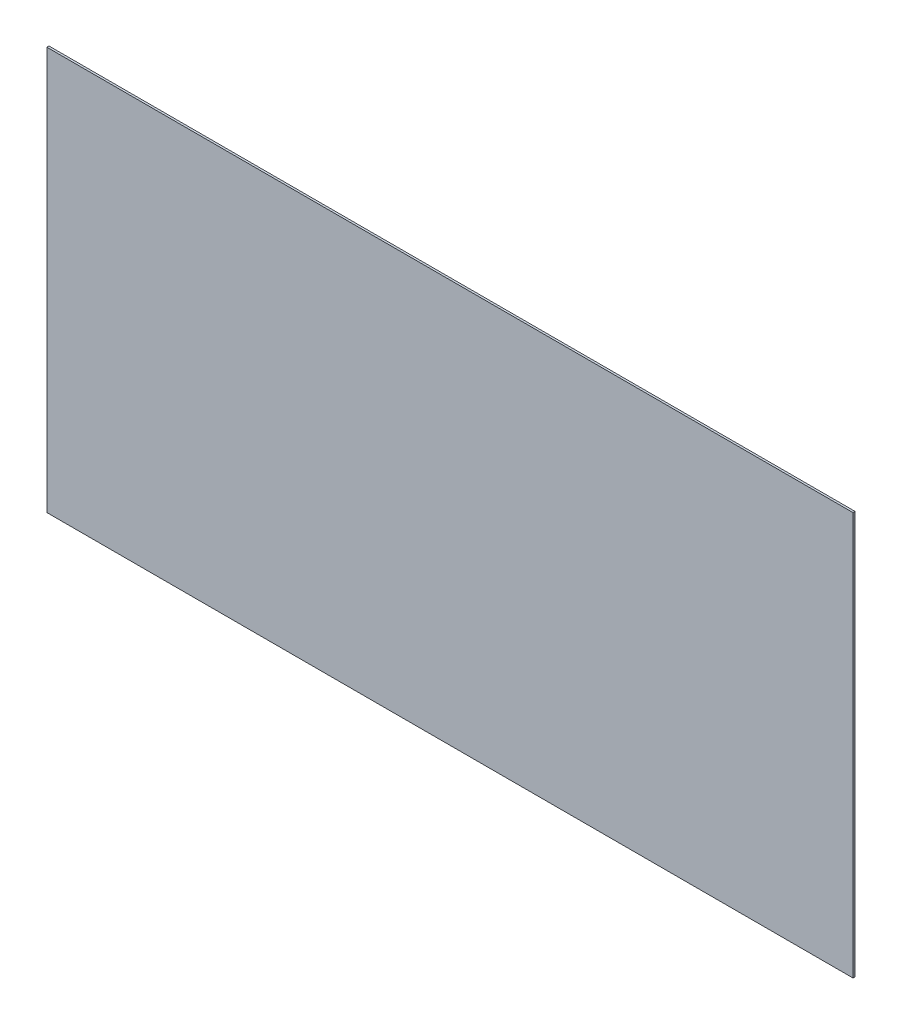
ISO-10303-21;
HEADER;
FILE_DESCRIPTION(('STEP AP214'),'2;1');
FILE_NAME('part.step','',(''),(''),'','','');
FILE_SCHEMA(('AUTOMOTIVE_DESIGN { 1 0 10303 214 1 1 1 1 }'));
ENDSEC;
DATA;
#1=APPLICATION_CONTEXT('core data for automotive mechanical design processes');
#2=APPLICATION_PROTOCOL_DEFINITION('international standard','automotive_design',2000,#1);
#3=PRODUCT_CONTEXT('',#1,'mechanical');
#4=PRODUCT('Part','Part','',(#3));
#5=PRODUCT_RELATED_PRODUCT_CATEGORY('part','',(#4));
#6=PRODUCT_DEFINITION_FORMATION('','',#4);
#7=PRODUCT_DEFINITION_CONTEXT('part definition',#1,'design');
#8=PRODUCT_DEFINITION('design','',#6,#7);
#9=PRODUCT_DEFINITION_SHAPE('','',#8);
#10=(LENGTH_UNIT() NAMED_UNIT(*) SI_UNIT(.MILLI.,.METRE.));
#11=(NAMED_UNIT(*) PLANE_ANGLE_UNIT() SI_UNIT($,.RADIAN.));
#12=(NAMED_UNIT(*) SI_UNIT($,.STERADIAN.) SOLID_ANGLE_UNIT());
#13=UNCERTAINTY_MEASURE_WITH_UNIT(LENGTH_MEASURE(1.E-05),#10,'distance_accuracy_value','');
#14=(GEOMETRIC_REPRESENTATION_CONTEXT(3) GLOBAL_UNCERTAINTY_ASSIGNED_CONTEXT((#13)) GLOBAL_UNIT_ASSIGNED_CONTEXT((#10,
#11,#12)) REPRESENTATION_CONTEXT('',''));
#15=CARTESIAN_POINT('',(0.,0.,0.));
#16=DIRECTION('',(0.,0.,1.));
#17=DIRECTION('',(1.,0.,0.));
#18=AXIS2_PLACEMENT_3D('',#15,#16,#17);
#19=CARTESIAN_POINT('',(878.526984661534,-434.184127533958,4.7625));
#20=DIRECTION('',(0.,0.,1.));
#21=DIRECTION('',(1.,0.,0.));
#22=AXIS2_PLACEMENT_3D('',#19,#20,#21);
#23=PLANE('',#22);
#24=DIRECTION('',(0.,1.,0.));
#25=VECTOR('',#24,1.);
#26=CARTESIAN_POINT('',(1792.92698466153,23.0158724660431,4.7625));
#27=LINE('',#26,#25);
#28=CARTESIAN_POINT('',(1792.92698466153,23.0158724660431,4.7625));
#29=VERTEX_POINT('',#28);
#30=CARTESIAN_POINT('',(1792.92698466153,-891.384127533958,4.7625));
#31=VERTEX_POINT('',#30);
#32=EDGE_CURVE('E68',#29,#31,#27,.F.);
#33=ORIENTED_EDGE('',*,*,#32,.F.);
#34=DIRECTION('',(1.,0.,0.));
#35=VECTOR('',#34,1.);
#36=CARTESIAN_POINT('',(-35.8730153384662,23.0158724660431,4.7625));
#37=LINE('',#36,#35);
#38=CARTESIAN_POINT('',(-35.8730153384662,23.0158724660431,4.7625));
#39=VERTEX_POINT('',#38);
#40=EDGE_CURVE('E20',#39,#29,#37,.T.);
#41=ORIENTED_EDGE('',*,*,#40,.F.);
#42=DIRECTION('',(0.,1.,0.));
#43=VECTOR('',#42,1.);
#44=CARTESIAN_POINT('',(-35.8730153384662,-891.384127533958,4.7625));
#45=LINE('',#44,#43);
#46=CARTESIAN_POINT('',(-35.8730153384662,-891.384127533958,4.7625));
#47=VERTEX_POINT('',#46);
#48=EDGE_CURVE('E58',#47,#39,#45,.T.);
#49=ORIENTED_EDGE('',*,*,#48,.F.);
#50=DIRECTION('',(1.,0.,0.));
#51=VECTOR('',#50,1.);
#52=CARTESIAN_POINT('',(1792.92698466153,-891.384127533958,4.7625));
#53=LINE('',#52,#51);
#54=EDGE_CURVE('E53',#31,#47,#53,.F.);
#55=ORIENTED_EDGE('',*,*,#54,.F.);
#56=EDGE_LOOP('',(#33,#41,#49,#55));
#57=FACE_BOUND('',#56,.T.);
#58=ADVANCED_FACE('F17',(#57),#23,.T.);
#59=CARTESIAN_POINT('',(-35.8730153384662,23.0158724660431,0.));
#60=DIRECTION('',(0.,1.,0.));
#61=DIRECTION('',(0.,0.,1.));
#62=AXIS2_PLACEMENT_3D('',#59,#60,#61);
#63=PLANE('',#62);
#64=ORIENTED_EDGE('',*,*,#40,.T.);
#65=DIRECTION('',(0.,0.,-1.));
#66=VECTOR('',#65,1.);
#67=CARTESIAN_POINT('',(1792.92698466153,23.0158724660431,0.));
#68=LINE('',#67,#66);
#69=CARTESIAN_POINT('',(1792.92698466153,23.0158724660431,0.));
#70=VERTEX_POINT('',#69);
#71=EDGE_CURVE('E79',#70,#29,#68,.F.);
#72=ORIENTED_EDGE('',*,*,#71,.F.);
#73=DIRECTION('',(1.,0.,0.));
#74=VECTOR('',#73,1.);
#75=CARTESIAN_POINT('',(878.526984661534,23.0158724660431,0.));
#76=LINE('',#75,#74);
#77=CARTESIAN_POINT('',(-35.8730153384662,23.0158724660431,0.));
#78=VERTEX_POINT('',#77);
#79=EDGE_CURVE('E74',#70,#78,#76,.F.);
#80=ORIENTED_EDGE('',*,*,#79,.T.);
#81=DIRECTION('',(0.,0.,1.));
#82=VECTOR('',#81,1.);
#83=CARTESIAN_POINT('',(-35.8730153384662,23.0158724660431,0.));
#84=LINE('',#83,#82);
#85=EDGE_CURVE('E63',#39,#78,#84,.F.);
#86=ORIENTED_EDGE('',*,*,#85,.F.);
#87=EDGE_LOOP('',(#64,#72,#80,#86));
#88=FACE_BOUND('',#87,.T.);
#89=ADVANCED_FACE('F73',(#88),#63,.T.);
#90=CARTESIAN_POINT('',(-35.8730153384662,-891.384127533958,0.));
#91=DIRECTION('',(-1.,0.,0.));
#92=DIRECTION('',(0.,0.,1.));
#93=AXIS2_PLACEMENT_3D('',#90,#91,#92);
#94=PLANE('',#93);
#95=ORIENTED_EDGE('',*,*,#48,.T.);
#96=ORIENTED_EDGE('',*,*,#85,.T.);
#97=DIRECTION('',(0.,1.,0.));
#98=VECTOR('',#97,1.);
#99=CARTESIAN_POINT('',(-35.8730153384662,-434.184127533958,0.));
#100=LINE('',#99,#98);
#101=CARTESIAN_POINT('',(-35.8730153384662,-891.384127533958,0.));
#102=VERTEX_POINT('',#101);
#103=EDGE_CURVE('E84',#78,#102,#100,.F.);
#104=ORIENTED_EDGE('',*,*,#103,.T.);
#105=DIRECTION('',(0.,0.,-1.));
#106=VECTOR('',#105,1.);
#107=CARTESIAN_POINT('',(-35.8730153384661,-891.384127533958,0.));
#108=LINE('',#107,#106);
#109=EDGE_CURVE('E65',#47,#102,#108,.T.);
#110=ORIENTED_EDGE('',*,*,#109,.F.);
#111=EDGE_LOOP('',(#95,#96,#104,#110));
#112=FACE_BOUND('',#111,.T.);
#113=ADVANCED_FACE('F60',(#112),#94,.T.);
#114=CARTESIAN_POINT('',(1792.92698466153,-891.384127533958,0.));
#115=DIRECTION('',(0.,-1.,0.));
#116=DIRECTION('',(0.,0.,-1.));
#117=AXIS2_PLACEMENT_3D('',#114,#115,#116);
#118=PLANE('',#117);
#119=ORIENTED_EDGE('',*,*,#54,.T.);
#120=ORIENTED_EDGE('',*,*,#109,.T.);
#121=DIRECTION('',(1.,0.,0.));
#122=VECTOR('',#121,1.);
#123=CARTESIAN_POINT('',(878.526984661534,-891.384127533958,0.));
#124=LINE('',#123,#122);
#125=CARTESIAN_POINT('',(1792.92698466153,-891.384127533958,0.));
#126=VERTEX_POINT('',#125);
#127=EDGE_CURVE('E26',#102,#126,#124,.T.);
#128=ORIENTED_EDGE('',*,*,#127,.T.);
#129=DIRECTION('',(0.,0.,-1.));
#130=VECTOR('',#129,1.);
#131=CARTESIAN_POINT('',(1792.92698466153,-891.384127533958,0.));
#132=LINE('',#131,#130);
#133=EDGE_CURVE('E34',#31,#126,#132,.T.);
#134=ORIENTED_EDGE('',*,*,#133,.F.);
#135=EDGE_LOOP('',(#119,#120,#128,#134));
#136=FACE_BOUND('',#135,.T.);
#137=ADVANCED_FACE('F88',(#136),#118,.T.);
#138=CARTESIAN_POINT('',(1792.92698466153,23.0158724660431,0.));
#139=DIRECTION('',(1.,0.,0.));
#140=DIRECTION('',(0.,0.,-1.));
#141=AXIS2_PLACEMENT_3D('',#138,#139,#140);
#142=PLANE('',#141);
#143=ORIENTED_EDGE('',*,*,#32,.T.);
#144=ORIENTED_EDGE('',*,*,#133,.T.);
#145=DIRECTION('',(0.,1.,0.));
#146=VECTOR('',#145,1.);
#147=CARTESIAN_POINT('',(1792.92698466153,-434.184127533958,0.));
#148=LINE('',#147,#146);
#149=EDGE_CURVE('E11',#126,#70,#148,.T.);
#150=ORIENTED_EDGE('',*,*,#149,.T.);
#151=ORIENTED_EDGE('',*,*,#71,.T.);
#152=EDGE_LOOP('',(#143,#144,#150,#151));
#153=FACE_BOUND('',#152,.T.);
#154=ADVANCED_FACE('F91',(#153),#142,.T.);
#155=CARTESIAN_POINT('',(878.526984661534,-434.184127533958,0.));
#156=DIRECTION('',(0.,0.,1.));
#157=DIRECTION('',(1.,0.,0.));
#158=AXIS2_PLACEMENT_3D('',#155,#156,#157);
#159=PLANE('',#158);
#160=ORIENTED_EDGE('',*,*,#127,.F.);
#161=ORIENTED_EDGE('',*,*,#103,.F.);
#162=ORIENTED_EDGE('',*,*,#79,.F.);
#163=ORIENTED_EDGE('',*,*,#149,.F.);
#164=EDGE_LOOP('',(#160,#161,#162,#163));
#165=FACE_BOUND('',#164,.T.);
#166=ADVANCED_FACE('F90',(#165),#159,.F.);
#167=CLOSED_SHELL('',(#58,#89,#113,#137,#154,#166));
#168=MANIFOLD_SOLID_BREP('B1',#167);
#169=ADVANCED_BREP_SHAPE_REPRESENTATION('',(#18,#168),#14);
#170=SHAPE_DEFINITION_REPRESENTATION(#9,#169);
ENDSEC;
END-ISO-10303-21;
